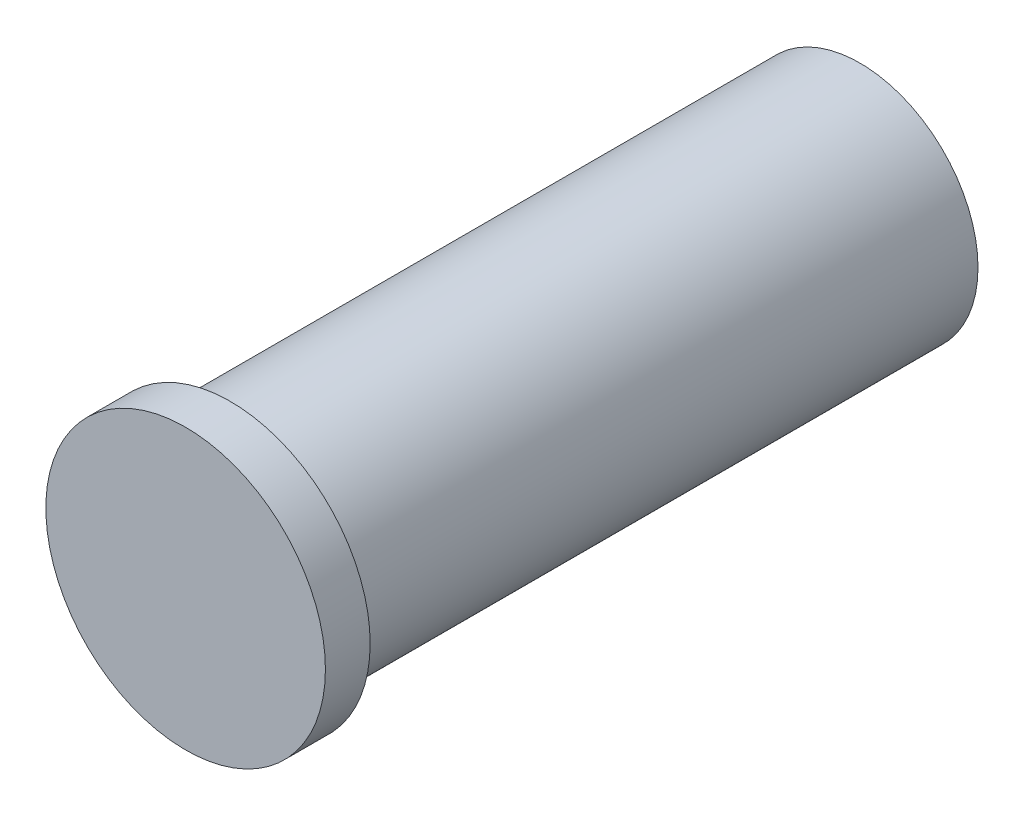
ISO-10303-21;
HEADER;
FILE_DESCRIPTION(('STEP AP214'),'2;1');
FILE_NAME('part.step','',(''),(''),'','','');
FILE_SCHEMA(('AUTOMOTIVE_DESIGN { 1 0 10303 214 1 1 1 1 }'));
ENDSEC;
DATA;
#1=APPLICATION_CONTEXT('core data for automotive mechanical design processes');
#2=APPLICATION_PROTOCOL_DEFINITION('international standard','automotive_design',2000,#1);
#3=PRODUCT_CONTEXT('',#1,'mechanical');
#4=PRODUCT('Part','Part','',(#3));
#5=PRODUCT_RELATED_PRODUCT_CATEGORY('part','',(#4));
#6=PRODUCT_DEFINITION_FORMATION('','',#4);
#7=PRODUCT_DEFINITION_CONTEXT('part definition',#1,'design');
#8=PRODUCT_DEFINITION('design','',#6,#7);
#9=PRODUCT_DEFINITION_SHAPE('','',#8);
#10=(LENGTH_UNIT() NAMED_UNIT(*) SI_UNIT(.MILLI.,.METRE.));
#11=(NAMED_UNIT(*) PLANE_ANGLE_UNIT() SI_UNIT($,.RADIAN.));
#12=(NAMED_UNIT(*) SI_UNIT($,.STERADIAN.) SOLID_ANGLE_UNIT());
#13=UNCERTAINTY_MEASURE_WITH_UNIT(LENGTH_MEASURE(1.E-05),#10,'distance_accuracy_value','');
#14=(GEOMETRIC_REPRESENTATION_CONTEXT(3) GLOBAL_UNCERTAINTY_ASSIGNED_CONTEXT((#13)) GLOBAL_UNIT_ASSIGNED_CONTEXT((#10,
#11,#12)) REPRESENTATION_CONTEXT('',''));
#15=CARTESIAN_POINT('',(0.,0.,0.));
#16=DIRECTION('',(0.,0.,1.));
#17=DIRECTION('',(1.,0.,0.));
#18=AXIS2_PLACEMENT_3D('',#15,#16,#17);
#19=CARTESIAN_POINT('',(0.,0.,0.));
#20=DIRECTION('',(0.,0.,1.));
#21=DIRECTION('',(1.,0.,0.));
#22=AXIS2_PLACEMENT_3D('',#19,#20,#21);
#23=PLANE('',#22);
#24=CARTESIAN_POINT('',(0.,0.,0.));
#25=DIRECTION('',(0.,0.,1.));
#26=DIRECTION('',(1.,0.,0.));
#27=AXIS2_PLACEMENT_3D('',#24,#25,#26);
#28=CIRCLE('',#27,21.11111111375);
#29=CARTESIAN_POINT('',(21.11111111375,0.,0.));
#30=VERTEX_POINT('',#29);
#31=EDGE_CURVE('E43',#30,#30,#28,.T.);
#32=ORIENTED_EDGE('',*,*,#31,.F.);
#33=EDGE_LOOP('',(#32));
#34=FACE_BOUND('',#33,.T.);
#35=CARTESIAN_POINT('',(0.,0.,0.));
#36=DIRECTION('',(0.,0.,1.));
#37=DIRECTION('',(1.,0.,0.));
#38=AXIS2_PLACEMENT_3D('',#35,#36,#37);
#39=CIRCLE('',#38,19.000000002375);
#40=CARTESIAN_POINT('',(19.000000002375,0.,0.));
#41=VERTEX_POINT('',#40);
#42=EDGE_CURVE('E52',#41,#41,#39,.T.);
#43=ORIENTED_EDGE('',*,*,#42,.T.);
#44=EDGE_LOOP('',(#43));
#45=FACE_BOUND('',#44,.T.);
#46=ADVANCED_FACE('F39',(#34,#45),#23,.F.);
#47=CARTESIAN_POINT('',(0.,0.,112.592592606667));
#48=DIRECTION('',(0.,0.,-1.));
#49=DIRECTION('',(-1.,0.,0.));
#50=AXIS2_PLACEMENT_3D('',#47,#48,#49);
#51=CYLINDRICAL_SURFACE('',#50,21.11111111375);
#52=CARTESIAN_POINT('',(0.,0.,112.592592606667));
#53=DIRECTION('',(0.,0.,1.));
#54=DIRECTION('',(1.,0.,0.));
#55=AXIS2_PLACEMENT_3D('',#52,#53,#54);
#56=CIRCLE('',#55,21.11111111375);
#57=CARTESIAN_POINT('',(21.11111111375,0.,112.592592606667));
#58=VERTEX_POINT('',#57);
#59=EDGE_CURVE('E10',#58,#58,#56,.T.);
#60=ORIENTED_EDGE('',*,*,#59,.F.);
#61=EDGE_LOOP('',(#60));
#62=FACE_BOUND('',#61,.T.);
#63=ORIENTED_EDGE('',*,*,#31,.T.);
#64=EDGE_LOOP('',(#63));
#65=FACE_BOUND('',#64,.T.);
#66=ADVANCED_FACE('F41',(#62,#65),#51,.T.);
#67=CARTESIAN_POINT('',(0.,0.,112.592592606667));
#68=DIRECTION('',(0.,0.,-1.));
#69=DIRECTION('',(-1.,0.,0.));
#70=AXIS2_PLACEMENT_3D('',#67,#68,#69);
#71=CYLINDRICAL_SURFACE('',#70,19.000000002375);
#72=CARTESIAN_POINT('',(0.,0.,112.592592606667));
#73=DIRECTION('',(0.,0.,1.));
#74=DIRECTION('',(1.,0.,0.));
#75=AXIS2_PLACEMENT_3D('',#72,#73,#74);
#76=CIRCLE('',#75,19.000000002375);
#77=CARTESIAN_POINT('',(19.000000002375,0.,112.592592606667));
#78=VERTEX_POINT('',#77);
#79=EDGE_CURVE('E57',#78,#78,#76,.T.);
#80=ORIENTED_EDGE('',*,*,#79,.T.);
#81=EDGE_LOOP('',(#80));
#82=FACE_BOUND('',#81,.T.);
#83=ORIENTED_EDGE('',*,*,#42,.F.);
#84=EDGE_LOOP('',(#83));
#85=FACE_BOUND('',#84,.T.);
#86=ADVANCED_FACE('F87',(#82,#85),#71,.F.);
#87=CARTESIAN_POINT('',(0.,0.,112.592592606667));
#88=DIRECTION('',(0.,0.,1.));
#89=DIRECTION('',(1.,0.,0.));
#90=AXIS2_PLACEMENT_3D('',#87,#88,#89);
#91=PLANE('',#90);
#92=ORIENTED_EDGE('',*,*,#79,.F.);
#93=EDGE_LOOP('',(#92));
#94=FACE_BOUND('',#93,.T.);
#95=ADVANCED_FACE('F75',(#94),#91,.F.);
#96=CARTESIAN_POINT('',(0.,0.,120.592592606667));
#97=DIRECTION('',(0.,0.,-1.));
#98=DIRECTION('',(-1.,0.,0.));
#99=AXIS2_PLACEMENT_3D('',#96,#97,#98);
#100=CYLINDRICAL_SURFACE('',#99,25.);
#101=CARTESIAN_POINT('',(0.,0.,120.592592606667));
#102=DIRECTION('',(0.,0.,1.));
#103=DIRECTION('',(1.,0.,0.));
#104=AXIS2_PLACEMENT_3D('',#101,#102,#103);
#105=CIRCLE('',#104,25.);
#106=CARTESIAN_POINT('',(25.,0.,120.592592606667));
#107=VERTEX_POINT('',#106);
#108=EDGE_CURVE('E61',#107,#107,#105,.T.);
#109=ORIENTED_EDGE('',*,*,#108,.F.);
#110=EDGE_LOOP('',(#109));
#111=FACE_BOUND('',#110,.T.);
#112=CARTESIAN_POINT('',(0.,0.,112.592592606667));
#113=DIRECTION('',(0.,0.,1.));
#114=DIRECTION('',(1.,0.,0.));
#115=AXIS2_PLACEMENT_3D('',#112,#113,#114);
#116=CIRCLE('',#115,25.);
#117=CARTESIAN_POINT('',(25.,0.,112.592592606667));
#118=VERTEX_POINT('',#117);
#119=EDGE_CURVE('E62',#118,#118,#116,.T.);
#120=ORIENTED_EDGE('',*,*,#119,.T.);
#121=EDGE_LOOP('',(#120));
#122=FACE_BOUND('',#121,.T.);
#123=ADVANCED_FACE('F72',(#111,#122),#100,.T.);
#124=CARTESIAN_POINT('',(0.,0.,120.592592606667));
#125=DIRECTION('',(0.,0.,1.));
#126=DIRECTION('',(1.,0.,0.));
#127=AXIS2_PLACEMENT_3D('',#124,#125,#126);
#128=PLANE('',#127);
#129=ORIENTED_EDGE('',*,*,#108,.T.);
#130=EDGE_LOOP('',(#129));
#131=FACE_BOUND('',#130,.T.);
#132=ADVANCED_FACE('F70',(#131),#128,.T.);
#133=ORIENTED_EDGE('',*,*,#59,.T.);
#134=EDGE_LOOP('',(#133));
#135=FACE_BOUND('',#134,.T.);
#136=ORIENTED_EDGE('',*,*,#119,.F.);
#137=EDGE_LOOP('',(#136));
#138=FACE_BOUND('',#137,.T.);
#139=ADVANCED_FACE('F79',(#135,#138),#91,.F.);
#140=CLOSED_SHELL('',(#46,#66,#86,#95,#123,#132,#139));
#141=MANIFOLD_SOLID_BREP('B2',#140);
#142=ADVANCED_BREP_SHAPE_REPRESENTATION('',(#18,#141),#14);
#143=SHAPE_DEFINITION_REPRESENTATION(#9,#142);
ENDSEC;
END-ISO-10303-21;
